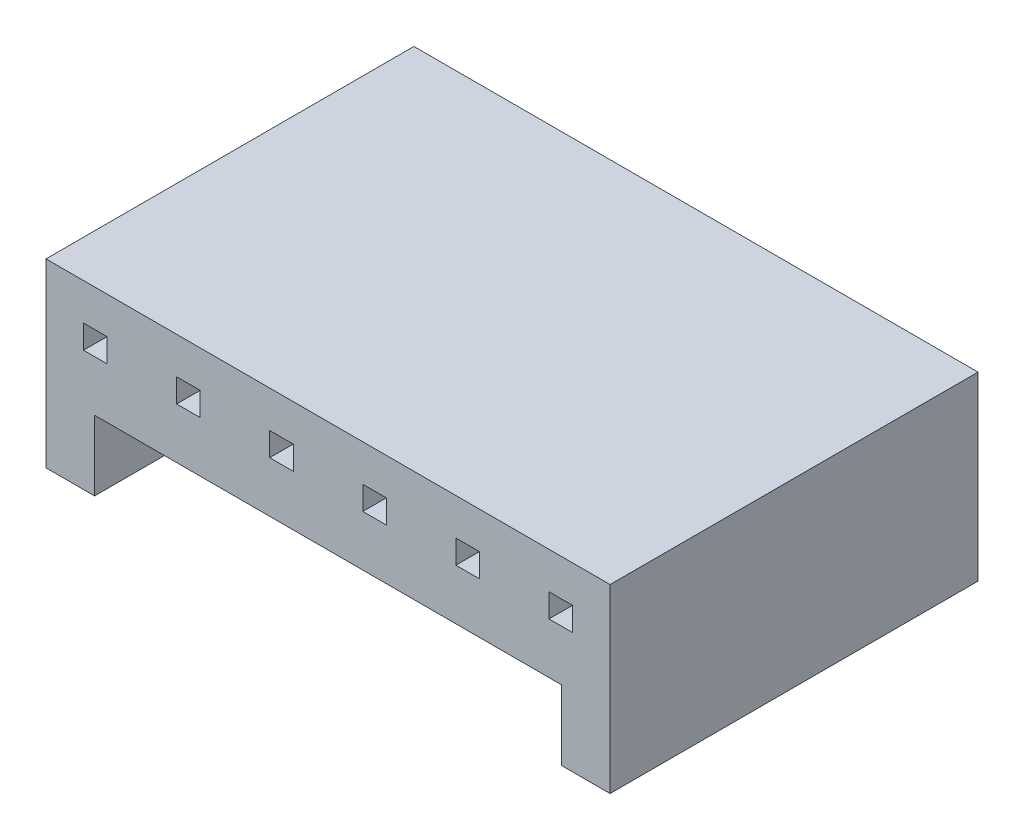
ISO-10303-21;
HEADER;
FILE_DESCRIPTION(('STEP AP214'),'2;1');
FILE_NAME('part.step','',(''),(''),'','','');
FILE_SCHEMA(('AUTOMOTIVE_DESIGN { 1 0 10303 214 1 1 1 1 }'));
ENDSEC;
DATA;
#1=APPLICATION_CONTEXT('core data for automotive mechanical design processes');
#2=APPLICATION_PROTOCOL_DEFINITION('international standard','automotive_design',2000,#1);
#3=PRODUCT_CONTEXT('',#1,'mechanical');
#4=PRODUCT('Part','Part','',(#3));
#5=PRODUCT_RELATED_PRODUCT_CATEGORY('part','',(#4));
#6=PRODUCT_DEFINITION_FORMATION('','',#4);
#7=PRODUCT_DEFINITION_CONTEXT('part definition',#1,'design');
#8=PRODUCT_DEFINITION('design','',#6,#7);
#9=PRODUCT_DEFINITION_SHAPE('','',#8);
#10=(LENGTH_UNIT() NAMED_UNIT(*) SI_UNIT(.MILLI.,.METRE.));
#11=(NAMED_UNIT(*) PLANE_ANGLE_UNIT() SI_UNIT($,.RADIAN.));
#12=(NAMED_UNIT(*) SI_UNIT($,.STERADIAN.) SOLID_ANGLE_UNIT());
#13=UNCERTAINTY_MEASURE_WITH_UNIT(LENGTH_MEASURE(1.E-05),#10,'distance_accuracy_value','');
#14=(GEOMETRIC_REPRESENTATION_CONTEXT(3) GLOBAL_UNCERTAINTY_ASSIGNED_CONTEXT((#13)) GLOBAL_UNIT_ASSIGNED_CONTEXT((#10,
#11,#12)) REPRESENTATION_CONTEXT('',''));
#15=CARTESIAN_POINT('',(0.,0.,0.));
#16=DIRECTION('',(0.,0.,1.));
#17=DIRECTION('',(1.,0.,0.));
#18=AXIS2_PLACEMENT_3D('',#15,#16,#17);
#19=CARTESIAN_POINT('',(0.,-35.6556582286529,10.));
#20=DIRECTION('',(0.,1.,0.));
#21=DIRECTION('',(0.,0.,1.));
#22=AXIS2_PLACEMENT_3D('',#19,#20,#21);
#23=PLANE('',#22);
#24=DIRECTION('',(1.,0.,0.));
#25=VECTOR('',#24,1.);
#26=CARTESIAN_POINT('',(0.,-35.6556582286529,0.));
#27=LINE('',#26,#25);
#28=CARTESIAN_POINT('',(-42.0158225105638,-35.6556582286529,0.));
#29=VERTEX_POINT('',#28);
#30=CARTESIAN_POINT('',(-41.3758225105638,-35.6556582286529,0.));
#31=VERTEX_POINT('',#30);
#32=EDGE_CURVE('E395',#29,#31,#27,.T.);
#33=ORIENTED_EDGE('',*,*,#32,.T.);
#34=DIRECTION('',(0.,0.,-1.));
#35=VECTOR('',#34,1.);
#36=CARTESIAN_POINT('',(-41.3758225105638,-35.6556582286529,10.));
#37=LINE('',#36,#35);
#38=CARTESIAN_POINT('',(-41.3758225105638,-35.6556582286529,10.));
#39=VERTEX_POINT('',#38);
#40=EDGE_CURVE('E11',#39,#31,#37,.T.);
#41=ORIENTED_EDGE('',*,*,#40,.F.);
#42=DIRECTION('',(1.,0.,0.));
#43=VECTOR('',#42,1.);
#44=CARTESIAN_POINT('',(0.,-35.6556582286529,10.));
#45=LINE('',#44,#43);
#46=CARTESIAN_POINT('',(-42.0158225105638,-35.6556582286529,10.));
#47=VERTEX_POINT('',#46);
#48=EDGE_CURVE('E265',#47,#39,#45,.T.);
#49=ORIENTED_EDGE('',*,*,#48,.F.);
#50=DIRECTION('',(0.,0.,-1.));
#51=VECTOR('',#50,1.);
#52=CARTESIAN_POINT('',(-42.0158225105638,-35.6556582286529,10.));
#53=LINE('',#52,#51);
#54=EDGE_CURVE('E61',#47,#29,#53,.T.);
#55=ORIENTED_EDGE('',*,*,#54,.T.);
#56=EDGE_LOOP('',(#33,#41,#49,#55));
#57=FACE_BOUND('',#56,.T.);
#58=ADVANCED_FACE('F41',(#57),#23,.F.);
#59=CARTESIAN_POINT('',(-41.3758225105638,0.,10.));
#60=DIRECTION('',(1.,0.,0.));
#61=DIRECTION('',(0.,0.,-1.));
#62=AXIS2_PLACEMENT_3D('',#59,#60,#61);
#63=PLANE('',#62);
#64=DIRECTION('',(0.,-1.,0.));
#65=VECTOR('',#64,1.);
#66=CARTESIAN_POINT('',(-41.3758225105638,0.,0.));
#67=LINE('',#66,#65);
#68=CARTESIAN_POINT('',(-41.3758225105638,-36.2956582286529,0.));
#69=VERTEX_POINT('',#68);
#70=EDGE_CURVE('E272',#31,#69,#67,.T.);
#71=ORIENTED_EDGE('',*,*,#70,.T.);
#72=DIRECTION('',(0.,0.,-1.));
#73=VECTOR('',#72,1.);
#74=CARTESIAN_POINT('',(-41.3758225105638,-36.2956582286529,10.));
#75=LINE('',#74,#73);
#76=CARTESIAN_POINT('',(-41.3758225105638,-36.2956582286529,10.));
#77=VERTEX_POINT('',#76);
#78=EDGE_CURVE('E52',#77,#69,#75,.T.);
#79=ORIENTED_EDGE('',*,*,#78,.F.);
#80=DIRECTION('',(0.,-1.,0.));
#81=VECTOR('',#80,1.);
#82=CARTESIAN_POINT('',(-41.3758225105638,0.,10.));
#83=LINE('',#82,#81);
#84=EDGE_CURVE('E259',#39,#77,#83,.T.);
#85=ORIENTED_EDGE('',*,*,#84,.F.);
#86=ORIENTED_EDGE('',*,*,#40,.T.);
#87=EDGE_LOOP('',(#71,#79,#85,#86));
#88=FACE_BOUND('',#87,.T.);
#89=ADVANCED_FACE('F271',(#88),#63,.F.);
#90=CARTESIAN_POINT('',(0.,-36.2956582286529,10.));
#91=DIRECTION('',(0.,1.,0.));
#92=DIRECTION('',(0.,0.,1.));
#93=AXIS2_PLACEMENT_3D('',#90,#91,#92);
#94=PLANE('',#93);
#95=DIRECTION('',(1.,0.,0.));
#96=VECTOR('',#95,1.);
#97=CARTESIAN_POINT('',(0.,-36.2956582286529,0.));
#98=LINE('',#97,#96);
#99=CARTESIAN_POINT('',(-42.0158225105638,-36.2956582286529,0.));
#100=VERTEX_POINT('',#99);
#101=EDGE_CURVE('E400',#100,#69,#98,.T.);
#102=ORIENTED_EDGE('',*,*,#101,.F.);
#103=DIRECTION('',(0.,0.,-1.));
#104=VECTOR('',#103,1.);
#105=CARTESIAN_POINT('',(-42.0158225105638,-36.2956582286529,10.));
#106=LINE('',#105,#104);
#107=CARTESIAN_POINT('',(-42.0158225105638,-36.2956582286529,10.));
#108=VERTEX_POINT('',#107);
#109=EDGE_CURVE('E159',#108,#100,#106,.T.);
#110=ORIENTED_EDGE('',*,*,#109,.F.);
#111=DIRECTION('',(1.,0.,0.));
#112=VECTOR('',#111,1.);
#113=CARTESIAN_POINT('',(0.,-36.2956582286529,10.));
#114=LINE('',#113,#112);
#115=EDGE_CURVE('E264',#108,#77,#114,.T.);
#116=ORIENTED_EDGE('',*,*,#115,.T.);
#117=ORIENTED_EDGE('',*,*,#78,.T.);
#118=EDGE_LOOP('',(#102,#110,#116,#117));
#119=FACE_BOUND('',#118,.T.);
#120=ADVANCED_FACE('F277',(#119),#94,.T.);
#121=CARTESIAN_POINT('',(0.,-36.2956582286529,10.));
#122=DIRECTION('',(0.,1.,0.));
#123=DIRECTION('',(0.,0.,1.));
#124=AXIS2_PLACEMENT_3D('',#121,#122,#123);
#125=PLANE('',#124);
#126=DIRECTION('',(1.,0.,0.));
#127=VECTOR('',#126,1.);
#128=CARTESIAN_POINT('',(0.,-36.2956582286529,0.));
#129=LINE('',#128,#127);
#130=CARTESIAN_POINT('',(-39.4858225105638,-36.2956582286529,0.));
#131=VERTEX_POINT('',#130);
#132=CARTESIAN_POINT('',(-38.8458225105638,-36.2956582286529,0.));
#133=VERTEX_POINT('',#132);
#134=EDGE_CURVE('E379',#131,#133,#129,.T.);
#135=ORIENTED_EDGE('',*,*,#134,.F.);
#136=DIRECTION('',(0.,0.,-1.));
#137=VECTOR('',#136,1.);
#138=CARTESIAN_POINT('',(-39.4858225105638,-36.2956582286529,10.));
#139=LINE('',#138,#137);
#140=CARTESIAN_POINT('',(-39.4858225105638,-36.2956582286529,10.));
#141=VERTEX_POINT('',#140);
#142=EDGE_CURVE('E410',#141,#131,#139,.T.);
#143=ORIENTED_EDGE('',*,*,#142,.F.);
#144=DIRECTION('',(1.,0.,0.));
#145=VECTOR('',#144,1.);
#146=CARTESIAN_POINT('',(0.,-36.2956582286529,10.));
#147=LINE('',#146,#145);
#148=CARTESIAN_POINT('',(-38.8458225105638,-36.2956582286529,10.));
#149=VERTEX_POINT('',#148);
#150=EDGE_CURVE('E621',#141,#149,#147,.T.);
#151=ORIENTED_EDGE('',*,*,#150,.T.);
#152=DIRECTION('',(0.,0.,-1.));
#153=VECTOR('',#152,1.);
#154=CARTESIAN_POINT('',(-38.8458225105638,-36.2956582286529,10.));
#155=LINE('',#154,#153);
#156=EDGE_CURVE('E413',#149,#133,#155,.T.);
#157=ORIENTED_EDGE('',*,*,#156,.T.);
#158=EDGE_LOOP('',(#135,#143,#151,#157));
#159=FACE_BOUND('',#158,.T.);
#160=ADVANCED_FACE('F646',(#159),#125,.T.);
#161=CARTESIAN_POINT('',(-39.4858225105638,0.,10.));
#162=DIRECTION('',(1.,0.,0.));
#163=DIRECTION('',(0.,0.,-1.));
#164=AXIS2_PLACEMENT_3D('',#161,#162,#163);
#165=PLANE('',#164);
#166=DIRECTION('',(0.,-1.,0.));
#167=VECTOR('',#166,1.);
#168=CARTESIAN_POINT('',(-39.4858225105638,0.,0.));
#169=LINE('',#168,#167);
#170=CARTESIAN_POINT('',(-39.4858225105638,-35.6556582286529,0.));
#171=VERTEX_POINT('',#170);
#172=EDGE_CURVE('E383',#171,#131,#169,.T.);
#173=ORIENTED_EDGE('',*,*,#172,.F.);
#174=DIRECTION('',(0.,0.,-1.));
#175=VECTOR('',#174,1.);
#176=CARTESIAN_POINT('',(-39.4858225105638,-35.6556582286529,10.));
#177=LINE('',#176,#175);
#178=CARTESIAN_POINT('',(-39.4858225105638,-35.6556582286529,10.));
#179=VERTEX_POINT('',#178);
#180=EDGE_CURVE('E421',#179,#171,#177,.T.);
#181=ORIENTED_EDGE('',*,*,#180,.F.);
#182=DIRECTION('',(0.,-1.,0.));
#183=VECTOR('',#182,1.);
#184=CARTESIAN_POINT('',(-39.4858225105638,0.,10.));
#185=LINE('',#184,#183);
#186=EDGE_CURVE('E625',#179,#141,#185,.T.);
#187=ORIENTED_EDGE('',*,*,#186,.T.);
#188=ORIENTED_EDGE('',*,*,#142,.T.);
#189=EDGE_LOOP('',(#173,#181,#187,#188));
#190=FACE_BOUND('',#189,.T.);
#191=ADVANCED_FACE('F649',(#190),#165,.T.);
#192=CARTESIAN_POINT('',(0.,-35.6556582286529,10.));
#193=DIRECTION('',(0.,1.,0.));
#194=DIRECTION('',(0.,0.,1.));
#195=AXIS2_PLACEMENT_3D('',#192,#193,#194);
#196=PLANE('',#195);
#197=DIRECTION('',(1.,0.,0.));
#198=VECTOR('',#197,1.);
#199=CARTESIAN_POINT('',(0.,-35.6556582286529,0.));
#200=LINE('',#199,#198);
#201=CARTESIAN_POINT('',(-38.8458225105638,-35.6556582286529,0.));
#202=VERTEX_POINT('',#201);
#203=EDGE_CURVE('E387',#171,#202,#200,.T.);
#204=ORIENTED_EDGE('',*,*,#203,.T.);
#205=DIRECTION('',(0.,0.,-1.));
#206=VECTOR('',#205,1.);
#207=CARTESIAN_POINT('',(-38.8458225105638,-35.6556582286529,10.));
#208=LINE('',#207,#206);
#209=CARTESIAN_POINT('',(-38.8458225105638,-35.6556582286529,10.));
#210=VERTEX_POINT('',#209);
#211=EDGE_CURVE('E416',#210,#202,#208,.T.);
#212=ORIENTED_EDGE('',*,*,#211,.F.);
#213=DIRECTION('',(1.,0.,0.));
#214=VECTOR('',#213,1.);
#215=CARTESIAN_POINT('',(0.,-35.6556582286529,10.));
#216=LINE('',#215,#214);
#217=EDGE_CURVE('E629',#179,#210,#216,.T.);
#218=ORIENTED_EDGE('',*,*,#217,.F.);
#219=ORIENTED_EDGE('',*,*,#180,.T.);
#220=EDGE_LOOP('',(#204,#212,#218,#219));
#221=FACE_BOUND('',#220,.T.);
#222=ADVANCED_FACE('F652',(#221),#196,.F.);
#223=CARTESIAN_POINT('',(0.,-36.2956582286529,10.));
#224=DIRECTION('',(0.,1.,0.));
#225=DIRECTION('',(0.,0.,1.));
#226=AXIS2_PLACEMENT_3D('',#223,#224,#225);
#227=PLANE('',#226);
#228=DIRECTION('',(1.,0.,0.));
#229=VECTOR('',#228,1.);
#230=CARTESIAN_POINT('',(0.,-36.2956582286529,0.));
#231=LINE('',#230,#229);
#232=CARTESIAN_POINT('',(-31.8958225105638,-36.2956582286529,0.));
#233=VERTEX_POINT('',#232);
#234=CARTESIAN_POINT('',(-31.2558225105638,-36.2956582286529,0.));
#235=VERTEX_POINT('',#234);
#236=EDGE_CURVE('E363',#233,#235,#231,.T.);
#237=ORIENTED_EDGE('',*,*,#236,.F.);
#238=DIRECTION('',(0.,0.,-1.));
#239=VECTOR('',#238,1.);
#240=CARTESIAN_POINT('',(-31.8958225105638,-36.2956582286529,10.));
#241=LINE('',#240,#239);
#242=CARTESIAN_POINT('',(-31.8958225105638,-36.2956582286529,10.));
#243=VERTEX_POINT('',#242);
#244=EDGE_CURVE('E417',#243,#233,#241,.T.);
#245=ORIENTED_EDGE('',*,*,#244,.F.);
#246=DIRECTION('',(1.,0.,0.));
#247=VECTOR('',#246,1.);
#248=CARTESIAN_POINT('',(0.,-36.2956582286529,10.));
#249=LINE('',#248,#247);
#250=CARTESIAN_POINT('',(-31.2558225105638,-36.2956582286529,10.));
#251=VERTEX_POINT('',#250);
#252=EDGE_CURVE('E606',#243,#251,#249,.T.);
#253=ORIENTED_EDGE('',*,*,#252,.T.);
#254=DIRECTION('',(0.,0.,-1.));
#255=VECTOR('',#254,1.);
#256=CARTESIAN_POINT('',(-31.2558225105638,-36.2956582286529,10.));
#257=LINE('',#256,#255);
#258=EDGE_CURVE('E426',#251,#235,#257,.T.);
#259=ORIENTED_EDGE('',*,*,#258,.T.);
#260=EDGE_LOOP('',(#237,#245,#253,#259));
#261=FACE_BOUND('',#260,.T.);
#262=ADVANCED_FACE('F680',(#261),#227,.T.);
#263=CARTESIAN_POINT('',(-31.8958225105638,0.,10.));
#264=DIRECTION('',(1.,0.,0.));
#265=DIRECTION('',(0.,0.,-1.));
#266=AXIS2_PLACEMENT_3D('',#263,#264,#265);
#267=PLANE('',#266);
#268=DIRECTION('',(0.,-1.,0.));
#269=VECTOR('',#268,1.);
#270=CARTESIAN_POINT('',(-31.8958225105638,0.,0.));
#271=LINE('',#270,#269);
#272=CARTESIAN_POINT('',(-31.8958225105638,-35.6556582286529,0.));
#273=VERTEX_POINT('',#272);
#274=EDGE_CURVE('E367',#273,#233,#271,.T.);
#275=ORIENTED_EDGE('',*,*,#274,.F.);
#276=DIRECTION('',(0.,0.,-1.));
#277=VECTOR('',#276,1.);
#278=CARTESIAN_POINT('',(-31.8958225105638,-35.6556582286529,10.));
#279=LINE('',#278,#277);
#280=CARTESIAN_POINT('',(-31.8958225105638,-35.6556582286529,10.));
#281=VERTEX_POINT('',#280);
#282=EDGE_CURVE('E434',#281,#273,#279,.T.);
#283=ORIENTED_EDGE('',*,*,#282,.F.);
#284=DIRECTION('',(0.,-1.,0.));
#285=VECTOR('',#284,1.);
#286=CARTESIAN_POINT('',(-31.8958225105638,0.,10.));
#287=LINE('',#286,#285);
#288=EDGE_CURVE('E610',#281,#243,#287,.T.);
#289=ORIENTED_EDGE('',*,*,#288,.T.);
#290=ORIENTED_EDGE('',*,*,#244,.T.);
#291=EDGE_LOOP('',(#275,#283,#289,#290));
#292=FACE_BOUND('',#291,.T.);
#293=ADVANCED_FACE('F693',(#292),#267,.T.);
#294=CARTESIAN_POINT('',(0.,-35.6556582286529,10.));
#295=DIRECTION('',(0.,1.,0.));
#296=DIRECTION('',(0.,0.,1.));
#297=AXIS2_PLACEMENT_3D('',#294,#295,#296);
#298=PLANE('',#297);
#299=DIRECTION('',(1.,0.,0.));
#300=VECTOR('',#299,1.);
#301=CARTESIAN_POINT('',(0.,-35.6556582286529,0.));
#302=LINE('',#301,#300);
#303=CARTESIAN_POINT('',(-31.2558225105638,-35.6556582286529,0.));
#304=VERTEX_POINT('',#303);
#305=EDGE_CURVE('E371',#273,#304,#302,.T.);
#306=ORIENTED_EDGE('',*,*,#305,.T.);
#307=DIRECTION('',(0.,0.,-1.));
#308=VECTOR('',#307,1.);
#309=CARTESIAN_POINT('',(-31.2558225105638,-35.6556582286529,10.));
#310=LINE('',#309,#308);
#311=CARTESIAN_POINT('',(-31.2558225105638,-35.6556582286529,10.));
#312=VERTEX_POINT('',#311);
#313=EDGE_CURVE('E429',#312,#304,#310,.T.);
#314=ORIENTED_EDGE('',*,*,#313,.F.);
#315=DIRECTION('',(1.,0.,0.));
#316=VECTOR('',#315,1.);
#317=CARTESIAN_POINT('',(0.,-35.6556582286529,10.));
#318=LINE('',#317,#316);
#319=EDGE_CURVE('E614',#281,#312,#318,.T.);
#320=ORIENTED_EDGE('',*,*,#319,.F.);
#321=ORIENTED_EDGE('',*,*,#282,.T.);
#322=EDGE_LOOP('',(#306,#314,#320,#321));
#323=FACE_BOUND('',#322,.T.);
#324=ADVANCED_FACE('F689',(#323),#298,.F.);
#325=CARTESIAN_POINT('',(0.,-36.2956582286529,10.));
#326=DIRECTION('',(0.,1.,0.));
#327=DIRECTION('',(0.,0.,1.));
#328=AXIS2_PLACEMENT_3D('',#325,#326,#327);
#329=PLANE('',#328);
#330=DIRECTION('',(1.,0.,0.));
#331=VECTOR('',#330,1.);
#332=CARTESIAN_POINT('',(0.,-36.2956582286529,0.));
#333=LINE('',#332,#331);
#334=CARTESIAN_POINT('',(-29.3658225105638,-36.2956582286529,0.));
#335=VERTEX_POINT('',#334);
#336=CARTESIAN_POINT('',(-28.7258225105638,-36.2956582286529,0.));
#337=VERTEX_POINT('',#336);
#338=EDGE_CURVE('E347',#335,#337,#333,.T.);
#339=ORIENTED_EDGE('',*,*,#338,.F.);
#340=DIRECTION('',(0.,0.,-1.));
#341=VECTOR('',#340,1.);
#342=CARTESIAN_POINT('',(-29.3658225105638,-36.2956582286529,10.));
#343=LINE('',#342,#341);
#344=CARTESIAN_POINT('',(-29.3658225105638,-36.2956582286529,10.));
#345=VERTEX_POINT('',#344);
#346=EDGE_CURVE('E430',#345,#335,#343,.T.);
#347=ORIENTED_EDGE('',*,*,#346,.F.);
#348=DIRECTION('',(1.,0.,0.));
#349=VECTOR('',#348,1.);
#350=CARTESIAN_POINT('',(0.,-36.2956582286529,10.));
#351=LINE('',#350,#349);
#352=CARTESIAN_POINT('',(-28.7258225105638,-36.2956582286529,10.));
#353=VERTEX_POINT('',#352);
#354=EDGE_CURVE('E591',#345,#353,#351,.T.);
#355=ORIENTED_EDGE('',*,*,#354,.T.);
#356=DIRECTION('',(0.,0.,-1.));
#357=VECTOR('',#356,1.);
#358=CARTESIAN_POINT('',(-28.7258225105638,-36.2956582286529,10.));
#359=LINE('',#358,#357);
#360=EDGE_CURVE('E439',#353,#337,#359,.T.);
#361=ORIENTED_EDGE('',*,*,#360,.T.);
#362=EDGE_LOOP('',(#339,#347,#355,#361));
#363=FACE_BOUND('',#362,.T.);
#364=ADVANCED_FACE('F692',(#363),#329,.T.);
#365=CARTESIAN_POINT('',(-29.3658225105638,0.,10.));
#366=DIRECTION('',(1.,0.,0.));
#367=DIRECTION('',(0.,0.,-1.));
#368=AXIS2_PLACEMENT_3D('',#365,#366,#367);
#369=PLANE('',#368);
#370=DIRECTION('',(0.,-1.,0.));
#371=VECTOR('',#370,1.);
#372=CARTESIAN_POINT('',(-29.3658225105638,0.,0.));
#373=LINE('',#372,#371);
#374=CARTESIAN_POINT('',(-29.3658225105638,-35.6556582286529,0.));
#375=VERTEX_POINT('',#374);
#376=EDGE_CURVE('E351',#375,#335,#373,.T.);
#377=ORIENTED_EDGE('',*,*,#376,.F.);
#378=DIRECTION('',(0.,0.,-1.));
#379=VECTOR('',#378,1.);
#380=CARTESIAN_POINT('',(-29.3658225105638,-35.6556582286529,10.));
#381=LINE('',#380,#379);
#382=CARTESIAN_POINT('',(-29.3658225105638,-35.6556582286529,10.));
#383=VERTEX_POINT('',#382);
#384=EDGE_CURVE('E447',#383,#375,#381,.T.);
#385=ORIENTED_EDGE('',*,*,#384,.F.);
#386=DIRECTION('',(0.,-1.,0.));
#387=VECTOR('',#386,1.);
#388=CARTESIAN_POINT('',(-29.3658225105638,0.,10.));
#389=LINE('',#388,#387);
#390=EDGE_CURVE('E595',#383,#345,#389,.T.);
#391=ORIENTED_EDGE('',*,*,#390,.T.);
#392=ORIENTED_EDGE('',*,*,#346,.T.);
#393=EDGE_LOOP('',(#377,#385,#391,#392));
#394=FACE_BOUND('',#393,.T.);
#395=ADVANCED_FACE('F709',(#394),#369,.T.);
#396=CARTESIAN_POINT('',(0.,-35.6556582286529,10.));
#397=DIRECTION('',(0.,1.,0.));
#398=DIRECTION('',(0.,0.,1.));
#399=AXIS2_PLACEMENT_3D('',#396,#397,#398);
#400=PLANE('',#399);
#401=DIRECTION('',(1.,0.,0.));
#402=VECTOR('',#401,1.);
#403=CARTESIAN_POINT('',(0.,-35.6556582286529,0.));
#404=LINE('',#403,#402);
#405=CARTESIAN_POINT('',(-28.7258225105638,-35.6556582286529,0.));
#406=VERTEX_POINT('',#405);
#407=EDGE_CURVE('E355',#375,#406,#404,.T.);
#408=ORIENTED_EDGE('',*,*,#407,.T.);
#409=DIRECTION('',(0.,0.,-1.));
#410=VECTOR('',#409,1.);
#411=CARTESIAN_POINT('',(-28.7258225105638,-35.6556582286529,10.));
#412=LINE('',#411,#410);
#413=CARTESIAN_POINT('',(-28.7258225105638,-35.6556582286529,10.));
#414=VERTEX_POINT('',#413);
#415=EDGE_CURVE('E442',#414,#406,#412,.T.);
#416=ORIENTED_EDGE('',*,*,#415,.F.);
#417=DIRECTION('',(1.,0.,0.));
#418=VECTOR('',#417,1.);
#419=CARTESIAN_POINT('',(0.,-35.6556582286529,10.));
#420=LINE('',#419,#418);
#421=EDGE_CURVE('E599',#383,#414,#420,.T.);
#422=ORIENTED_EDGE('',*,*,#421,.F.);
#423=ORIENTED_EDGE('',*,*,#384,.T.);
#424=EDGE_LOOP('',(#408,#416,#422,#423));
#425=FACE_BOUND('',#424,.T.);
#426=ADVANCED_FACE('F705',(#425),#400,.F.);
#427=CARTESIAN_POINT('',(0.,-35.6556582286529,10.));
#428=DIRECTION('',(0.,1.,0.));
#429=DIRECTION('',(0.,0.,1.));
#430=AXIS2_PLACEMENT_3D('',#427,#428,#429);
#431=PLANE('',#430);
#432=DIRECTION('',(1.,0.,0.));
#433=VECTOR('',#432,1.);
#434=CARTESIAN_POINT('',(0.,-35.6556582286529,0.));
#435=LINE('',#434,#433);
#436=CARTESIAN_POINT('',(-36.9558225105638,-35.6556582286529,0.));
#437=VERTEX_POINT('',#436);
#438=CARTESIAN_POINT('',(-36.3158225105638,-35.6556582286529,0.));
#439=VERTEX_POINT('',#438);
#440=EDGE_CURVE('E331',#437,#439,#435,.T.);
#441=ORIENTED_EDGE('',*,*,#440,.T.);
#442=DIRECTION('',(0.,0.,-1.));
#443=VECTOR('',#442,1.);
#444=CARTESIAN_POINT('',(-36.3158225105638,-35.6556582286529,10.));
#445=LINE('',#444,#443);
#446=CARTESIAN_POINT('',(-36.3158225105638,-35.6556582286529,10.));
#447=VERTEX_POINT('',#446);
#448=EDGE_CURVE('E443',#447,#439,#445,.T.);
#449=ORIENTED_EDGE('',*,*,#448,.F.);
#450=DIRECTION('',(1.,0.,0.));
#451=VECTOR('',#450,1.);
#452=CARTESIAN_POINT('',(0.,-35.6556582286529,10.));
#453=LINE('',#452,#451);
#454=CARTESIAN_POINT('',(-36.9558225105638,-35.6556582286529,10.));
#455=VERTEX_POINT('',#454);
#456=EDGE_CURVE('E576',#455,#447,#453,.T.);
#457=ORIENTED_EDGE('',*,*,#456,.F.);
#458=DIRECTION('',(0.,0.,-1.));
#459=VECTOR('',#458,1.);
#460=CARTESIAN_POINT('',(-36.9558225105638,-35.6556582286529,10.));
#461=LINE('',#460,#459);
#462=EDGE_CURVE('E452',#455,#437,#461,.T.);
#463=ORIENTED_EDGE('',*,*,#462,.T.);
#464=EDGE_LOOP('',(#441,#449,#457,#463));
#465=FACE_BOUND('',#464,.T.);
#466=ADVANCED_FACE('F708',(#465),#431,.F.);
#467=CARTESIAN_POINT('',(-36.3158225105638,0.,10.));
#468=DIRECTION('',(1.,0.,0.));
#469=DIRECTION('',(0.,0.,-1.));
#470=AXIS2_PLACEMENT_3D('',#467,#468,#469);
#471=PLANE('',#470);
#472=DIRECTION('',(0.,-1.,0.));
#473=VECTOR('',#472,1.);
#474=CARTESIAN_POINT('',(-36.3158225105638,0.,0.));
#475=LINE('',#474,#473);
#476=CARTESIAN_POINT('',(-36.3158225105638,-36.2956582286529,0.));
#477=VERTEX_POINT('',#476);
#478=EDGE_CURVE('E335',#439,#477,#475,.T.);
#479=ORIENTED_EDGE('',*,*,#478,.T.);
#480=DIRECTION('',(0.,0.,-1.));
#481=VECTOR('',#480,1.);
#482=CARTESIAN_POINT('',(-36.3158225105638,-36.2956582286529,10.));
#483=LINE('',#482,#481);
#484=CARTESIAN_POINT('',(-36.3158225105638,-36.2956582286529,10.));
#485=VERTEX_POINT('',#484);
#486=EDGE_CURVE('E459',#485,#477,#483,.T.);
#487=ORIENTED_EDGE('',*,*,#486,.F.);
#488=DIRECTION('',(0.,-1.,0.));
#489=VECTOR('',#488,1.);
#490=CARTESIAN_POINT('',(-36.3158225105638,0.,10.));
#491=LINE('',#490,#489);
#492=EDGE_CURVE('E580',#447,#485,#491,.T.);
#493=ORIENTED_EDGE('',*,*,#492,.F.);
#494=ORIENTED_EDGE('',*,*,#448,.T.);
#495=EDGE_LOOP('',(#479,#487,#493,#494));
#496=FACE_BOUND('',#495,.T.);
#497=ADVANCED_FACE('F724',(#496),#471,.F.);
#498=CARTESIAN_POINT('',(0.,-36.2956582286529,10.));
#499=DIRECTION('',(0.,1.,0.));
#500=DIRECTION('',(0.,0.,1.));
#501=AXIS2_PLACEMENT_3D('',#498,#499,#500);
#502=PLANE('',#501);
#503=DIRECTION('',(1.,0.,0.));
#504=VECTOR('',#503,1.);
#505=CARTESIAN_POINT('',(0.,-36.2956582286529,0.));
#506=LINE('',#505,#504);
#507=CARTESIAN_POINT('',(-36.9558225105638,-36.2956582286529,0.));
#508=VERTEX_POINT('',#507);
#509=EDGE_CURVE('E339',#508,#477,#506,.T.);
#510=ORIENTED_EDGE('',*,*,#509,.F.);
#511=DIRECTION('',(0.,0.,-1.));
#512=VECTOR('',#511,1.);
#513=CARTESIAN_POINT('',(-36.9558225105638,-36.2956582286529,10.));
#514=LINE('',#513,#512);
#515=CARTESIAN_POINT('',(-36.9558225105638,-36.2956582286529,10.));
#516=VERTEX_POINT('',#515);
#517=EDGE_CURVE('E455',#516,#508,#514,.T.);
#518=ORIENTED_EDGE('',*,*,#517,.F.);
#519=DIRECTION('',(1.,0.,0.));
#520=VECTOR('',#519,1.);
#521=CARTESIAN_POINT('',(0.,-36.2956582286529,10.));
#522=LINE('',#521,#520);
#523=EDGE_CURVE('E583',#516,#485,#522,.T.);
#524=ORIENTED_EDGE('',*,*,#523,.T.);
#525=ORIENTED_EDGE('',*,*,#486,.T.);
#526=EDGE_LOOP('',(#510,#518,#524,#525));
#527=FACE_BOUND('',#526,.T.);
#528=ADVANCED_FACE('F720',(#527),#502,.T.);
#529=CARTESIAN_POINT('',(-34.4258225105638,0.,10.));
#530=DIRECTION('',(1.,0.,0.));
#531=DIRECTION('',(0.,0.,-1.));
#532=AXIS2_PLACEMENT_3D('',#529,#530,#531);
#533=PLANE('',#532);
#534=DIRECTION('',(0.,-1.,0.));
#535=VECTOR('',#534,1.);
#536=CARTESIAN_POINT('',(-34.4258225105638,0.,0.));
#537=LINE('',#536,#535);
#538=CARTESIAN_POINT('',(-34.4258225105638,-35.6556582286529,0.));
#539=VERTEX_POINT('',#538);
#540=CARTESIAN_POINT('',(-34.4258225105638,-36.2956582286529,0.));
#541=VERTEX_POINT('',#540);
#542=EDGE_CURVE('E315',#539,#541,#537,.T.);
#543=ORIENTED_EDGE('',*,*,#542,.F.);
#544=DIRECTION('',(0.,0.,-1.));
#545=VECTOR('',#544,1.);
#546=CARTESIAN_POINT('',(-34.4258225105638,-35.6556582286529,10.));
#547=LINE('',#546,#545);
#548=CARTESIAN_POINT('',(-34.4258225105638,-35.6556582286529,10.));
#549=VERTEX_POINT('',#548);
#550=EDGE_CURVE('E456',#549,#539,#547,.T.);
#551=ORIENTED_EDGE('',*,*,#550,.F.);
#552=DIRECTION('',(0.,-1.,0.));
#553=VECTOR('',#552,1.);
#554=CARTESIAN_POINT('',(-34.4258225105638,0.,10.));
#555=LINE('',#554,#553);
#556=CARTESIAN_POINT('',(-34.4258225105638,-36.2956582286529,10.));
#557=VERTEX_POINT('',#556);
#558=EDGE_CURVE('E561',#549,#557,#555,.T.);
#559=ORIENTED_EDGE('',*,*,#558,.T.);
#560=DIRECTION('',(0.,0.,-1.));
#561=VECTOR('',#560,1.);
#562=CARTESIAN_POINT('',(-34.4258225105638,-36.2956582286529,10.));
#563=LINE('',#562,#561);
#564=EDGE_CURVE('E465',#557,#541,#563,.T.);
#565=ORIENTED_EDGE('',*,*,#564,.T.);
#566=EDGE_LOOP('',(#543,#551,#559,#565));
#567=FACE_BOUND('',#566,.T.);
#568=ADVANCED_FACE('F723',(#567),#533,.T.);
#569=CARTESIAN_POINT('',(0.,-35.6556582286529,10.));
#570=DIRECTION('',(0.,1.,0.));
#571=DIRECTION('',(0.,0.,1.));
#572=AXIS2_PLACEMENT_3D('',#569,#570,#571);
#573=PLANE('',#572);
#574=DIRECTION('',(1.,0.,0.));
#575=VECTOR('',#574,1.);
#576=CARTESIAN_POINT('',(0.,-35.6556582286529,0.));
#577=LINE('',#576,#575);
#578=CARTESIAN_POINT('',(-33.7858225105638,-35.6556582286529,0.));
#579=VERTEX_POINT('',#578);
#580=EDGE_CURVE('E319',#539,#579,#577,.T.);
#581=ORIENTED_EDGE('',*,*,#580,.T.);
#582=DIRECTION('',(0.,0.,-1.));
#583=VECTOR('',#582,1.);
#584=CARTESIAN_POINT('',(-33.7858225105638,-35.6556582286529,10.));
#585=LINE('',#584,#583);
#586=CARTESIAN_POINT('',(-33.7858225105638,-35.6556582286529,10.));
#587=VERTEX_POINT('',#586);
#588=EDGE_CURVE('E471',#587,#579,#585,.T.);
#589=ORIENTED_EDGE('',*,*,#588,.F.);
#590=DIRECTION('',(1.,0.,0.));
#591=VECTOR('',#590,1.);
#592=CARTESIAN_POINT('',(0.,-35.6556582286529,10.));
#593=LINE('',#592,#591);
#594=EDGE_CURVE('E565',#549,#587,#593,.T.);
#595=ORIENTED_EDGE('',*,*,#594,.F.);
#596=ORIENTED_EDGE('',*,*,#550,.T.);
#597=EDGE_LOOP('',(#581,#589,#595,#596));
#598=FACE_BOUND('',#597,.T.);
#599=ADVANCED_FACE('F738',(#598),#573,.F.);
#600=CARTESIAN_POINT('',(-33.7858225105638,0.,10.));
#601=DIRECTION('',(1.,0.,0.));
#602=DIRECTION('',(0.,0.,-1.));
#603=AXIS2_PLACEMENT_3D('',#600,#601,#602);
#604=PLANE('',#603);
#605=DIRECTION('',(0.,-1.,0.));
#606=VECTOR('',#605,1.);
#607=CARTESIAN_POINT('',(-33.7858225105638,0.,0.));
#608=LINE('',#607,#606);
#609=CARTESIAN_POINT('',(-33.7858225105638,-36.2956582286529,0.));
#610=VERTEX_POINT('',#609);
#611=EDGE_CURVE('E323',#579,#610,#608,.T.);
#612=ORIENTED_EDGE('',*,*,#611,.T.);
#613=DIRECTION('',(0.,0.,-1.));
#614=VECTOR('',#613,1.);
#615=CARTESIAN_POINT('',(-33.7858225105638,-36.2956582286529,10.));
#616=LINE('',#615,#614);
#617=CARTESIAN_POINT('',(-33.7858225105638,-36.2956582286529,10.));
#618=VERTEX_POINT('',#617);
#619=EDGE_CURVE('E468',#618,#610,#616,.T.);
#620=ORIENTED_EDGE('',*,*,#619,.F.);
#621=DIRECTION('',(0.,-1.,0.));
#622=VECTOR('',#621,1.);
#623=CARTESIAN_POINT('',(-33.7858225105638,0.,10.));
#624=LINE('',#623,#622);
#625=EDGE_CURVE('E569',#587,#618,#624,.T.);
#626=ORIENTED_EDGE('',*,*,#625,.F.);
#627=ORIENTED_EDGE('',*,*,#588,.T.);
#628=EDGE_LOOP('',(#612,#620,#626,#627));
#629=FACE_BOUND('',#628,.T.);
#630=ADVANCED_FACE('F735',(#629),#604,.F.);
#631=CARTESIAN_POINT('',(0.,-34.6556582286529,10.));
#632=DIRECTION('',(0.,1.,0.));
#633=DIRECTION('',(0.,0.,1.));
#634=AXIS2_PLACEMENT_3D('',#631,#632,#633);
#635=PLANE('',#634);
#636=DIRECTION('',(1.,0.,0.));
#637=VECTOR('',#636,1.);
#638=CARTESIAN_POINT('',(0.,-34.6556582286529,0.));
#639=LINE('',#638,#637);
#640=CARTESIAN_POINT('',(-43.0358225105638,-34.6556582286529,0.));
#641=VERTEX_POINT('',#640);
#642=CARTESIAN_POINT('',(-27.7058225105638,-34.6556582286529,0.));
#643=VERTEX_POINT('',#642);
#644=EDGE_CURVE('E286',#641,#643,#639,.T.);
#645=ORIENTED_EDGE('',*,*,#644,.F.);
#646=DIRECTION('',(0.,0.,-1.));
#647=VECTOR('',#646,1.);
#648=CARTESIAN_POINT('',(-43.0358225105638,-34.6556582286529,10.));
#649=LINE('',#648,#647);
#650=CARTESIAN_POINT('',(-43.0358225105638,-34.6556582286529,10.));
#651=VERTEX_POINT('',#650);
#652=EDGE_CURVE('E45',#651,#641,#649,.T.);
#653=ORIENTED_EDGE('',*,*,#652,.F.);
#654=DIRECTION('',(1.,0.,0.));
#655=VECTOR('',#654,1.);
#656=CARTESIAN_POINT('',(0.,-34.6556582286529,10.));
#657=LINE('',#656,#655);
#658=CARTESIAN_POINT('',(-27.7058225105638,-34.6556582286529,10.));
#659=VERTEX_POINT('',#658);
#660=EDGE_CURVE('E407',#651,#659,#657,.T.);
#661=ORIENTED_EDGE('',*,*,#660,.T.);
#662=DIRECTION('',(0.,0.,-1.));
#663=VECTOR('',#662,1.);
#664=CARTESIAN_POINT('',(-27.7058225105638,-34.6556582286529,10.));
#665=LINE('',#664,#663);
#666=EDGE_CURVE('E282',#659,#643,#665,.T.);
#667=ORIENTED_EDGE('',*,*,#666,.T.);
#668=EDGE_LOOP('',(#645,#653,#661,#667));
#669=FACE_BOUND('',#668,.T.);
#670=ADVANCED_FACE('F43',(#669),#635,.T.);
#671=CARTESIAN_POINT('',(-43.0358225105638,0.,10.));
#672=DIRECTION('',(1.,0.,0.));
#673=DIRECTION('',(0.,0.,-1.));
#674=AXIS2_PLACEMENT_3D('',#671,#672,#673);
#675=PLANE('',#674);
#676=DIRECTION('',(0.,-1.,0.));
#677=VECTOR('',#676,1.);
#678=CARTESIAN_POINT('',(-43.0358225105638,0.,0.));
#679=LINE('',#678,#677);
#680=CARTESIAN_POINT('',(-43.0358225105638,-39.5756582286529,0.));
#681=VERTEX_POINT('',#680);
#682=EDGE_CURVE('E290',#641,#681,#679,.T.);
#683=ORIENTED_EDGE('',*,*,#682,.T.);
#684=DIRECTION('',(0.,0.,-1.));
#685=VECTOR('',#684,1.);
#686=CARTESIAN_POINT('',(-43.0358225105638,-39.5756582286529,10.));
#687=LINE('',#686,#685);
#688=CARTESIAN_POINT('',(-43.0358225105638,-39.5756582286529,10.));
#689=VERTEX_POINT('',#688);
#690=EDGE_CURVE('E495',#689,#681,#687,.T.);
#691=ORIENTED_EDGE('',*,*,#690,.F.);
#692=DIRECTION('',(0.,-1.,0.));
#693=VECTOR('',#692,1.);
#694=CARTESIAN_POINT('',(-43.0358225105638,0.,10.));
#695=LINE('',#694,#693);
#696=EDGE_CURVE('E506',#651,#689,#695,.T.);
#697=ORIENTED_EDGE('',*,*,#696,.F.);
#698=ORIENTED_EDGE('',*,*,#652,.T.);
#699=EDGE_LOOP('',(#683,#691,#697,#698));
#700=FACE_BOUND('',#699,.T.);
#701=ADVANCED_FACE('F505',(#700),#675,.F.);
#702=CARTESIAN_POINT('',(0.,-39.5756582286529,10.));
#703=DIRECTION('',(0.,1.,0.));
#704=DIRECTION('',(0.,0.,1.));
#705=AXIS2_PLACEMENT_3D('',#702,#703,#704);
#706=PLANE('',#705);
#707=DIRECTION('',(1.,0.,0.));
#708=VECTOR('',#707,1.);
#709=CARTESIAN_POINT('',(0.,-39.5756582286529,0.));
#710=LINE('',#709,#708);
#711=CARTESIAN_POINT('',(-41.7158225105638,-39.5756582286529,0.));
#712=VERTEX_POINT('',#711);
#713=EDGE_CURVE('E293',#681,#712,#710,.T.);
#714=ORIENTED_EDGE('',*,*,#713,.T.);
#715=DIRECTION('',(0.,0.,-1.));
#716=VECTOR('',#715,1.);
#717=CARTESIAN_POINT('',(-41.7158225105638,-39.5756582286529,10.));
#718=LINE('',#717,#716);
#719=CARTESIAN_POINT('',(-41.7158225105638,-39.5756582286529,10.));
#720=VERTEX_POINT('',#719);
#721=EDGE_CURVE('E492',#720,#712,#718,.T.);
#722=ORIENTED_EDGE('',*,*,#721,.F.);
#723=DIRECTION('',(1.,0.,0.));
#724=VECTOR('',#723,1.);
#725=CARTESIAN_POINT('',(0.,-39.5756582286529,10.));
#726=LINE('',#725,#724);
#727=EDGE_CURVE('E542',#689,#720,#726,.T.);
#728=ORIENTED_EDGE('',*,*,#727,.F.);
#729=ORIENTED_EDGE('',*,*,#690,.T.);
#730=EDGE_LOOP('',(#714,#722,#728,#729));
#731=FACE_BOUND('',#730,.T.);
#732=ADVANCED_FACE('F541',(#731),#706,.F.);
#733=CARTESIAN_POINT('',(-41.7158225105638,0.,10.));
#734=DIRECTION('',(-1.,0.,0.));
#735=DIRECTION('',(0.,0.,1.));
#736=AXIS2_PLACEMENT_3D('',#733,#734,#735);
#737=PLANE('',#736);
#738=DIRECTION('',(0.,1.,0.));
#739=VECTOR('',#738,1.);
#740=CARTESIAN_POINT('',(-41.7158225105638,0.,0.));
#741=LINE('',#740,#739);
#742=CARTESIAN_POINT('',(-41.7158225105638,-37.6756582286529,0.));
#743=VERTEX_POINT('',#742);
#744=EDGE_CURVE('E296',#712,#743,#741,.T.);
#745=ORIENTED_EDGE('',*,*,#744,.T.);
#746=DIRECTION('',(0.,0.,-1.));
#747=VECTOR('',#746,1.);
#748=CARTESIAN_POINT('',(-41.7158225105638,-37.6756582286529,10.));
#749=LINE('',#748,#747);
#750=CARTESIAN_POINT('',(-41.7158225105638,-37.6756582286529,10.));
#751=VERTEX_POINT('',#750);
#752=EDGE_CURVE('E488',#751,#743,#749,.T.);
#753=ORIENTED_EDGE('',*,*,#752,.F.);
#754=DIRECTION('',(0.,1.,0.));
#755=VECTOR('',#754,1.);
#756=CARTESIAN_POINT('',(-41.7158225105638,0.,10.));
#757=LINE('',#756,#755);
#758=EDGE_CURVE('E540',#720,#751,#757,.T.);
#759=ORIENTED_EDGE('',*,*,#758,.F.);
#760=ORIENTED_EDGE('',*,*,#721,.T.);
#761=EDGE_LOOP('',(#745,#753,#759,#760));
#762=FACE_BOUND('',#761,.T.);
#763=ADVANCED_FACE('F537',(#762),#737,.F.);
#764=CARTESIAN_POINT('',(0.,-37.6756582286529,10.));
#765=DIRECTION('',(0.,1.,0.));
#766=DIRECTION('',(0.,0.,1.));
#767=AXIS2_PLACEMENT_3D('',#764,#765,#766);
#768=PLANE('',#767);
#769=DIRECTION('',(1.,0.,0.));
#770=VECTOR('',#769,1.);
#771=CARTESIAN_POINT('',(0.,-37.6756582286529,0.));
#772=LINE('',#771,#770);
#773=CARTESIAN_POINT('',(-29.0258225105638,-37.6756582286529,0.));
#774=VERTEX_POINT('',#773);
#775=EDGE_CURVE('E299',#743,#774,#772,.T.);
#776=ORIENTED_EDGE('',*,*,#775,.T.);
#777=DIRECTION('',(0.,0.,-1.));
#778=VECTOR('',#777,1.);
#779=CARTESIAN_POINT('',(-29.0258225105638,-37.6756582286529,10.));
#780=LINE('',#779,#778);
#781=CARTESIAN_POINT('',(-29.0258225105638,-37.6756582286529,10.));
#782=VERTEX_POINT('',#781);
#783=EDGE_CURVE('E485',#782,#774,#780,.T.);
#784=ORIENTED_EDGE('',*,*,#783,.F.);
#785=DIRECTION('',(1.,0.,0.));
#786=VECTOR('',#785,1.);
#787=CARTESIAN_POINT('',(0.,-37.6756582286529,10.));
#788=LINE('',#787,#786);
#789=EDGE_CURVE('E548',#751,#782,#788,.T.);
#790=ORIENTED_EDGE('',*,*,#789,.F.);
#791=ORIENTED_EDGE('',*,*,#752,.T.);
#792=EDGE_LOOP('',(#776,#784,#790,#791));
#793=FACE_BOUND('',#792,.T.);
#794=ADVANCED_FACE('F534',(#793),#768,.F.);
#795=CARTESIAN_POINT('',(-29.0258225105638,0.,10.));
#796=DIRECTION('',(-1.,0.,0.));
#797=DIRECTION('',(0.,0.,1.));
#798=AXIS2_PLACEMENT_3D('',#795,#796,#797);
#799=PLANE('',#798);
#800=DIRECTION('',(0.,1.,0.));
#801=VECTOR('',#800,1.);
#802=CARTESIAN_POINT('',(-29.0258225105638,0.,0.));
#803=LINE('',#802,#801);
#804=CARTESIAN_POINT('',(-29.0258225105638,-39.5756582286529,0.));
#805=VERTEX_POINT('',#804);
#806=EDGE_CURVE('E303',#805,#774,#803,.T.);
#807=ORIENTED_EDGE('',*,*,#806,.F.);
#808=DIRECTION('',(0.,0.,-1.));
#809=VECTOR('',#808,1.);
#810=CARTESIAN_POINT('',(-29.0258225105638,-39.5756582286529,10.));
#811=LINE('',#810,#809);
#812=CARTESIAN_POINT('',(-29.0258225105638,-39.5756582286529,10.));
#813=VERTEX_POINT('',#812);
#814=EDGE_CURVE('E482',#813,#805,#811,.T.);
#815=ORIENTED_EDGE('',*,*,#814,.F.);
#816=DIRECTION('',(0.,1.,0.));
#817=VECTOR('',#816,1.);
#818=CARTESIAN_POINT('',(-29.0258225105638,0.,10.));
#819=LINE('',#818,#817);
#820=EDGE_CURVE('E531',#813,#782,#819,.T.);
#821=ORIENTED_EDGE('',*,*,#820,.T.);
#822=ORIENTED_EDGE('',*,*,#783,.T.);
#823=EDGE_LOOP('',(#807,#815,#821,#822));
#824=FACE_BOUND('',#823,.T.);
#825=ADVANCED_FACE('F529',(#824),#799,.T.);
#826=CARTESIAN_POINT('',(0.,-39.5756582286529,10.));
#827=DIRECTION('',(0.,-1.,0.));
#828=DIRECTION('',(0.,0.,-1.));
#829=AXIS2_PLACEMENT_3D('',#826,#827,#828);
#830=PLANE('',#829);
#831=DIRECTION('',(-1.,0.,0.));
#832=VECTOR('',#831,1.);
#833=CARTESIAN_POINT('',(0.,-39.5756582286529,0.));
#834=LINE('',#833,#832);
#835=CARTESIAN_POINT('',(-27.7058225105638,-39.5756582286529,0.));
#836=VERTEX_POINT('',#835);
#837=EDGE_CURVE('E307',#836,#805,#834,.T.);
#838=ORIENTED_EDGE('',*,*,#837,.F.);
#839=DIRECTION('',(0.,0.,-1.));
#840=VECTOR('',#839,1.);
#841=CARTESIAN_POINT('',(-27.7058225105638,-39.5756582286529,10.));
#842=LINE('',#841,#840);
#843=CARTESIAN_POINT('',(-27.7058225105638,-39.5756582286529,10.));
#844=VERTEX_POINT('',#843);
#845=EDGE_CURVE('E479',#844,#836,#842,.T.);
#846=ORIENTED_EDGE('',*,*,#845,.F.);
#847=DIRECTION('',(-1.,0.,0.));
#848=VECTOR('',#847,1.);
#849=CARTESIAN_POINT('',(0.,-39.5756582286529,10.));
#850=LINE('',#849,#848);
#851=EDGE_CURVE('E525',#844,#813,#850,.T.);
#852=ORIENTED_EDGE('',*,*,#851,.T.);
#853=ORIENTED_EDGE('',*,*,#814,.T.);
#854=EDGE_LOOP('',(#838,#846,#852,#853));
#855=FACE_BOUND('',#854,.T.);
#856=ADVANCED_FACE('F522',(#855),#830,.T.);
#857=CARTESIAN_POINT('',(-38.8458225105638,0.,10.));
#858=DIRECTION('',(1.,0.,0.));
#859=DIRECTION('',(0.,0.,-1.));
#860=AXIS2_PLACEMENT_3D('',#857,#858,#859);
#861=PLANE('',#860);
#862=DIRECTION('',(0.,-1.,0.));
#863=VECTOR('',#862,1.);
#864=CARTESIAN_POINT('',(-38.8458225105638,0.,0.));
#865=LINE('',#864,#863);
#866=EDGE_CURVE('E391',#202,#133,#865,.T.);
#867=ORIENTED_EDGE('',*,*,#866,.T.);
#868=ORIENTED_EDGE('',*,*,#156,.F.);
#869=DIRECTION('',(0.,-1.,0.));
#870=VECTOR('',#869,1.);
#871=CARTESIAN_POINT('',(-38.8458225105638,0.,10.));
#872=LINE('',#871,#870);
#873=EDGE_CURVE('E633',#210,#149,#872,.T.);
#874=ORIENTED_EDGE('',*,*,#873,.F.);
#875=ORIENTED_EDGE('',*,*,#211,.T.);
#876=EDGE_LOOP('',(#867,#868,#874,#875));
#877=FACE_BOUND('',#876,.T.);
#878=ADVANCED_FACE('F643',(#877),#861,.F.);
#879=CARTESIAN_POINT('',(-31.2558225105638,0.,10.));
#880=DIRECTION('',(1.,0.,0.));
#881=DIRECTION('',(0.,0.,-1.));
#882=AXIS2_PLACEMENT_3D('',#879,#880,#881);
#883=PLANE('',#882);
#884=DIRECTION('',(0.,-1.,0.));
#885=VECTOR('',#884,1.);
#886=CARTESIAN_POINT('',(-31.2558225105638,0.,0.));
#887=LINE('',#886,#885);
#888=EDGE_CURVE('E375',#304,#235,#887,.T.);
#889=ORIENTED_EDGE('',*,*,#888,.T.);
#890=ORIENTED_EDGE('',*,*,#258,.F.);
#891=DIRECTION('',(0.,-1.,0.));
#892=VECTOR('',#891,1.);
#893=CARTESIAN_POINT('',(-31.2558225105638,0.,10.));
#894=LINE('',#893,#892);
#895=EDGE_CURVE('E618',#312,#251,#894,.T.);
#896=ORIENTED_EDGE('',*,*,#895,.F.);
#897=ORIENTED_EDGE('',*,*,#313,.T.);
#898=EDGE_LOOP('',(#889,#890,#896,#897));
#899=FACE_BOUND('',#898,.T.);
#900=ADVANCED_FACE('F677',(#899),#883,.F.);
#901=CARTESIAN_POINT('',(-28.7258225105638,0.,10.));
#902=DIRECTION('',(1.,0.,0.));
#903=DIRECTION('',(0.,0.,-1.));
#904=AXIS2_PLACEMENT_3D('',#901,#902,#903);
#905=PLANE('',#904);
#906=DIRECTION('',(0.,-1.,0.));
#907=VECTOR('',#906,1.);
#908=CARTESIAN_POINT('',(-28.7258225105638,0.,0.));
#909=LINE('',#908,#907);
#910=EDGE_CURVE('E359',#406,#337,#909,.T.);
#911=ORIENTED_EDGE('',*,*,#910,.T.);
#912=ORIENTED_EDGE('',*,*,#360,.F.);
#913=DIRECTION('',(0.,-1.,0.));
#914=VECTOR('',#913,1.);
#915=CARTESIAN_POINT('',(-28.7258225105638,0.,10.));
#916=LINE('',#915,#914);
#917=EDGE_CURVE('E603',#414,#353,#916,.T.);
#918=ORIENTED_EDGE('',*,*,#917,.F.);
#919=ORIENTED_EDGE('',*,*,#415,.T.);
#920=EDGE_LOOP('',(#911,#912,#918,#919));
#921=FACE_BOUND('',#920,.T.);
#922=ADVANCED_FACE('F687',(#921),#905,.F.);
#923=CARTESIAN_POINT('',(-36.9558225105638,0.,10.));
#924=DIRECTION('',(1.,0.,0.));
#925=DIRECTION('',(0.,0.,-1.));
#926=AXIS2_PLACEMENT_3D('',#923,#924,#925);
#927=PLANE('',#926);
#928=DIRECTION('',(0.,-1.,0.));
#929=VECTOR('',#928,1.);
#930=CARTESIAN_POINT('',(-36.9558225105638,0.,0.));
#931=LINE('',#930,#929);
#932=EDGE_CURVE('E343',#437,#508,#931,.T.);
#933=ORIENTED_EDGE('',*,*,#932,.F.);
#934=ORIENTED_EDGE('',*,*,#462,.F.);
#935=DIRECTION('',(0.,-1.,0.));
#936=VECTOR('',#935,1.);
#937=CARTESIAN_POINT('',(-36.9558225105638,0.,10.));
#938=LINE('',#937,#936);
#939=EDGE_CURVE('E587',#455,#516,#938,.T.);
#940=ORIENTED_EDGE('',*,*,#939,.T.);
#941=ORIENTED_EDGE('',*,*,#517,.T.);
#942=EDGE_LOOP('',(#933,#934,#940,#941));
#943=FACE_BOUND('',#942,.T.);
#944=ADVANCED_FACE('F703',(#943),#927,.T.);
#945=CARTESIAN_POINT('',(0.,-36.2956582286529,10.));
#946=DIRECTION('',(0.,1.,0.));
#947=DIRECTION('',(0.,0.,1.));
#948=AXIS2_PLACEMENT_3D('',#945,#946,#947);
#949=PLANE('',#948);
#950=DIRECTION('',(1.,0.,0.));
#951=VECTOR('',#950,1.);
#952=CARTESIAN_POINT('',(0.,-36.2956582286529,0.));
#953=LINE('',#952,#951);
#954=EDGE_CURVE('E327',#541,#610,#953,.T.);
#955=ORIENTED_EDGE('',*,*,#954,.F.);
#956=ORIENTED_EDGE('',*,*,#564,.F.);
#957=DIRECTION('',(1.,0.,0.));
#958=VECTOR('',#957,1.);
#959=CARTESIAN_POINT('',(0.,-36.2956582286529,10.));
#960=LINE('',#959,#958);
#961=EDGE_CURVE('E572',#557,#618,#960,.T.);
#962=ORIENTED_EDGE('',*,*,#961,.T.);
#963=ORIENTED_EDGE('',*,*,#619,.T.);
#964=EDGE_LOOP('',(#955,#956,#962,#963));
#965=FACE_BOUND('',#964,.T.);
#966=ADVANCED_FACE('F665',(#965),#949,.T.);
#967=CARTESIAN_POINT('',(-27.7058225105638,0.,10.));
#968=DIRECTION('',(1.,0.,0.));
#969=DIRECTION('',(0.,0.,-1.));
#970=AXIS2_PLACEMENT_3D('',#967,#968,#969);
#971=PLANE('',#970);
#972=DIRECTION('',(0.,-1.,0.));
#973=VECTOR('',#972,1.);
#974=CARTESIAN_POINT('',(-27.7058225105638,0.,0.));
#975=LINE('',#974,#973);
#976=EDGE_CURVE('E311',#643,#836,#975,.T.);
#977=ORIENTED_EDGE('',*,*,#976,.F.);
#978=ORIENTED_EDGE('',*,*,#666,.F.);
#979=DIRECTION('',(0.,-1.,0.));
#980=VECTOR('',#979,1.);
#981=CARTESIAN_POINT('',(-27.7058225105638,0.,10.));
#982=LINE('',#981,#980);
#983=EDGE_CURVE('E517',#659,#844,#982,.T.);
#984=ORIENTED_EDGE('',*,*,#983,.T.);
#985=ORIENTED_EDGE('',*,*,#845,.T.);
#986=EDGE_LOOP('',(#977,#978,#984,#985));
#987=FACE_BOUND('',#986,.T.);
#988=ADVANCED_FACE('F516',(#987),#971,.T.);
#989=CARTESIAN_POINT('',(-42.0158225105638,0.,10.));
#990=DIRECTION('',(1.,0.,0.));
#991=DIRECTION('',(0.,0.,-1.));
#992=AXIS2_PLACEMENT_3D('',#989,#990,#991);
#993=PLANE('',#992);
#994=DIRECTION('',(0.,-1.,0.));
#995=VECTOR('',#994,1.);
#996=CARTESIAN_POINT('',(-42.0158225105638,0.,0.));
#997=LINE('',#996,#995);
#998=EDGE_CURVE('E403',#29,#100,#997,.T.);
#999=ORIENTED_EDGE('',*,*,#998,.F.);
#1000=ORIENTED_EDGE('',*,*,#54,.F.);
#1001=DIRECTION('',(0.,-1.,0.));
#1002=VECTOR('',#1001,1.);
#1003=CARTESIAN_POINT('',(-42.0158225105638,0.,10.));
#1004=LINE('',#1003,#1002);
#1005=EDGE_CURVE('E279',#47,#108,#1004,.T.);
#1006=ORIENTED_EDGE('',*,*,#1005,.T.);
#1007=ORIENTED_EDGE('',*,*,#109,.T.);
#1008=EDGE_LOOP('',(#999,#1000,#1006,#1007));
#1009=FACE_BOUND('',#1008,.T.);
#1010=ADVANCED_FACE('F657',(#1009),#993,.T.);
#1011=CARTESIAN_POINT('',(0.,0.,10.));
#1012=DIRECTION('',(0.,0.,1.));
#1013=DIRECTION('',(1.,0.,0.));
#1014=AXIS2_PLACEMENT_3D('',#1011,#1012,#1013);
#1015=PLANE('',#1014);
#1016=ORIENTED_EDGE('',*,*,#660,.F.);
#1017=ORIENTED_EDGE('',*,*,#696,.T.);
#1018=ORIENTED_EDGE('',*,*,#727,.T.);
#1019=ORIENTED_EDGE('',*,*,#758,.T.);
#1020=ORIENTED_EDGE('',*,*,#789,.T.);
#1021=ORIENTED_EDGE('',*,*,#820,.F.);
#1022=ORIENTED_EDGE('',*,*,#851,.F.);
#1023=ORIENTED_EDGE('',*,*,#983,.F.);
#1024=EDGE_LOOP('',(#1016,#1017,#1018,#1019,#1020,#1021,#1022,#1023));
#1025=FACE_BOUND('',#1024,.T.);
#1026=ORIENTED_EDGE('',*,*,#558,.F.);
#1027=ORIENTED_EDGE('',*,*,#594,.T.);
#1028=ORIENTED_EDGE('',*,*,#625,.T.);
#1029=ORIENTED_EDGE('',*,*,#961,.F.);
#1030=EDGE_LOOP('',(#1026,#1027,#1028,#1029));
#1031=FACE_BOUND('',#1030,.T.);
#1032=ORIENTED_EDGE('',*,*,#456,.T.);
#1033=ORIENTED_EDGE('',*,*,#492,.T.);
#1034=ORIENTED_EDGE('',*,*,#523,.F.);
#1035=ORIENTED_EDGE('',*,*,#939,.F.);
#1036=EDGE_LOOP('',(#1032,#1033,#1034,#1035));
#1037=FACE_BOUND('',#1036,.T.);
#1038=ORIENTED_EDGE('',*,*,#354,.F.);
#1039=ORIENTED_EDGE('',*,*,#390,.F.);
#1040=ORIENTED_EDGE('',*,*,#421,.T.);
#1041=ORIENTED_EDGE('',*,*,#917,.T.);
#1042=EDGE_LOOP('',(#1038,#1039,#1040,#1041));
#1043=FACE_BOUND('',#1042,.T.);
#1044=ORIENTED_EDGE('',*,*,#252,.F.);
#1045=ORIENTED_EDGE('',*,*,#288,.F.);
#1046=ORIENTED_EDGE('',*,*,#319,.T.);
#1047=ORIENTED_EDGE('',*,*,#895,.T.);
#1048=EDGE_LOOP('',(#1044,#1045,#1046,#1047));
#1049=FACE_BOUND('',#1048,.T.);
#1050=ORIENTED_EDGE('',*,*,#150,.F.);
#1051=ORIENTED_EDGE('',*,*,#186,.F.);
#1052=ORIENTED_EDGE('',*,*,#217,.T.);
#1053=ORIENTED_EDGE('',*,*,#873,.T.);
#1054=EDGE_LOOP('',(#1050,#1051,#1052,#1053));
#1055=FACE_BOUND('',#1054,.T.);
#1056=ORIENTED_EDGE('',*,*,#48,.T.);
#1057=ORIENTED_EDGE('',*,*,#84,.T.);
#1058=ORIENTED_EDGE('',*,*,#115,.F.);
#1059=ORIENTED_EDGE('',*,*,#1005,.F.);
#1060=EDGE_LOOP('',(#1056,#1057,#1058,#1059));
#1061=FACE_BOUND('',#1060,.T.);
#1062=ADVANCED_FACE('F261',(#1025,#1031,#1037,#1043,#1049,#1055,#1061),#1015,.T.);
#1063=CARTESIAN_POINT('',(0.,0.,0.));
#1064=DIRECTION('',(0.,0.,1.));
#1065=DIRECTION('',(1.,0.,0.));
#1066=AXIS2_PLACEMENT_3D('',#1063,#1064,#1065);
#1067=PLANE('',#1066);
#1068=ORIENTED_EDGE('',*,*,#644,.T.);
#1069=ORIENTED_EDGE('',*,*,#976,.T.);
#1070=ORIENTED_EDGE('',*,*,#837,.T.);
#1071=ORIENTED_EDGE('',*,*,#806,.T.);
#1072=ORIENTED_EDGE('',*,*,#775,.F.);
#1073=ORIENTED_EDGE('',*,*,#744,.F.);
#1074=ORIENTED_EDGE('',*,*,#713,.F.);
#1075=ORIENTED_EDGE('',*,*,#682,.F.);
#1076=EDGE_LOOP('',(#1068,#1069,#1070,#1071,#1072,#1073,#1074,#1075));
#1077=FACE_BOUND('',#1076,.T.);
#1078=ORIENTED_EDGE('',*,*,#542,.T.);
#1079=ORIENTED_EDGE('',*,*,#954,.T.);
#1080=ORIENTED_EDGE('',*,*,#611,.F.);
#1081=ORIENTED_EDGE('',*,*,#580,.F.);
#1082=EDGE_LOOP('',(#1078,#1079,#1080,#1081));
#1083=FACE_BOUND('',#1082,.T.);
#1084=ORIENTED_EDGE('',*,*,#440,.F.);
#1085=ORIENTED_EDGE('',*,*,#932,.T.);
#1086=ORIENTED_EDGE('',*,*,#509,.T.);
#1087=ORIENTED_EDGE('',*,*,#478,.F.);
#1088=EDGE_LOOP('',(#1084,#1085,#1086,#1087));
#1089=FACE_BOUND('',#1088,.T.);
#1090=ORIENTED_EDGE('',*,*,#338,.T.);
#1091=ORIENTED_EDGE('',*,*,#910,.F.);
#1092=ORIENTED_EDGE('',*,*,#407,.F.);
#1093=ORIENTED_EDGE('',*,*,#376,.T.);
#1094=EDGE_LOOP('',(#1090,#1091,#1092,#1093));
#1095=FACE_BOUND('',#1094,.T.);
#1096=ORIENTED_EDGE('',*,*,#236,.T.);
#1097=ORIENTED_EDGE('',*,*,#888,.F.);
#1098=ORIENTED_EDGE('',*,*,#305,.F.);
#1099=ORIENTED_EDGE('',*,*,#274,.T.);
#1100=EDGE_LOOP('',(#1096,#1097,#1098,#1099));
#1101=FACE_BOUND('',#1100,.T.);
#1102=ORIENTED_EDGE('',*,*,#134,.T.);
#1103=ORIENTED_EDGE('',*,*,#866,.F.);
#1104=ORIENTED_EDGE('',*,*,#203,.F.);
#1105=ORIENTED_EDGE('',*,*,#172,.T.);
#1106=EDGE_LOOP('',(#1102,#1103,#1104,#1105));
#1107=FACE_BOUND('',#1106,.T.);
#1108=ORIENTED_EDGE('',*,*,#32,.F.);
#1109=ORIENTED_EDGE('',*,*,#998,.T.);
#1110=ORIENTED_EDGE('',*,*,#101,.T.);
#1111=ORIENTED_EDGE('',*,*,#70,.F.);
#1112=EDGE_LOOP('',(#1108,#1109,#1110,#1111));
#1113=FACE_BOUND('',#1112,.T.);
#1114=ADVANCED_FACE('F509',(#1077,#1083,#1089,#1095,#1101,#1107,#1113),#1067,.F.);
#1115=CLOSED_SHELL('',(#58,#89,#120,#160,#191,#222,#262,#293,#324,#364,#395,#426,#466,#497,#528,
#568,#599,#630,#670,#701,#732,#763,#794,#825,#856,#878,#900,#922,#944,#966,#988,#1010,#1062,#1114));
#1116=MANIFOLD_SOLID_BREP('B2',#1115);
#1117=ADVANCED_BREP_SHAPE_REPRESENTATION('',(#18,#1116),#14);
#1118=SHAPE_DEFINITION_REPRESENTATION(#9,#1117);
ENDSEC;
END-ISO-10303-21;
